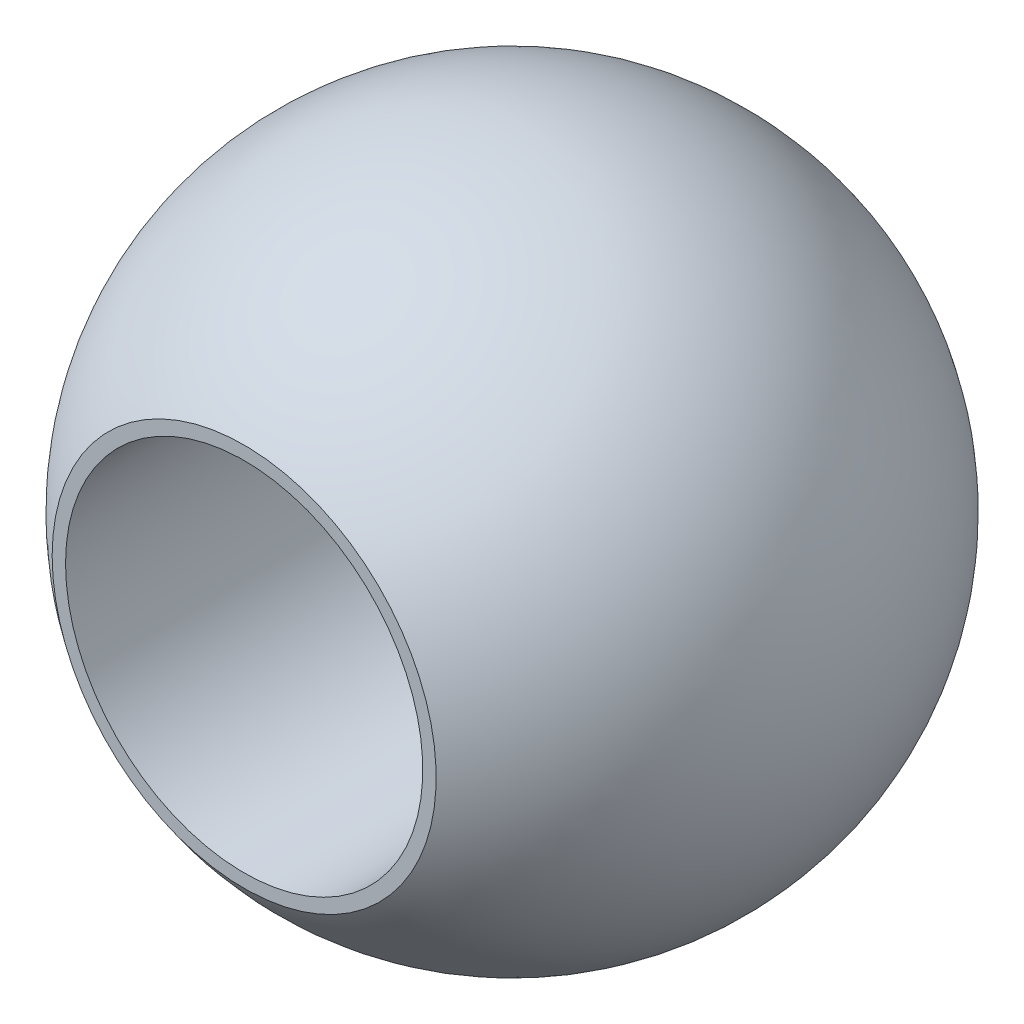
ISO-10303-21;
HEADER;
FILE_DESCRIPTION(('STEP AP214'),'2;1');
FILE_NAME('part.step','',(''),(''),'','','');
FILE_SCHEMA(('AUTOMOTIVE_DESIGN { 1 0 10303 214 1 1 1 1 }'));
ENDSEC;
DATA;
#1=APPLICATION_CONTEXT('core data for automotive mechanical design processes');
#2=APPLICATION_PROTOCOL_DEFINITION('international standard','automotive_design',2000,#1);
#3=PRODUCT_CONTEXT('',#1,'mechanical');
#4=PRODUCT('Part','Part','',(#3));
#5=PRODUCT_RELATED_PRODUCT_CATEGORY('part','',(#4));
#6=PRODUCT_DEFINITION_FORMATION('','',#4);
#7=PRODUCT_DEFINITION_CONTEXT('part definition',#1,'design');
#8=PRODUCT_DEFINITION('design','',#6,#7);
#9=PRODUCT_DEFINITION_SHAPE('','',#8);
#10=(LENGTH_UNIT() NAMED_UNIT(*) SI_UNIT(.MILLI.,.METRE.));
#11=(NAMED_UNIT(*) PLANE_ANGLE_UNIT() SI_UNIT($,.RADIAN.));
#12=(NAMED_UNIT(*) SI_UNIT($,.STERADIAN.) SOLID_ANGLE_UNIT());
#13=UNCERTAINTY_MEASURE_WITH_UNIT(LENGTH_MEASURE(1.E-05),#10,'distance_accuracy_value','');
#14=(GEOMETRIC_REPRESENTATION_CONTEXT(3) GLOBAL_UNCERTAINTY_ASSIGNED_CONTEXT((#13)) GLOBAL_UNIT_ASSIGNED_CONTEXT((#10,
#11,#12)) REPRESENTATION_CONTEXT('',''));
#15=CARTESIAN_POINT('',(0.,0.,0.));
#16=DIRECTION('',(0.,0.,1.));
#17=DIRECTION('',(1.,0.,0.));
#18=AXIS2_PLACEMENT_3D('',#15,#16,#17);
#19=CARTESIAN_POINT('',(4.,0.,-6.));
#20=DIRECTION('',(0.,0.,1.));
#21=DIRECTION('',(1.,0.,0.));
#22=AXIS2_PLACEMENT_3D('',#19,#20,#21);
#23=PLANE('',#22);
#24=CARTESIAN_POINT('',(0.,0.,-6.));
#25=DIRECTION('',(0.,0.,-1.));
#26=DIRECTION('',(-1.,0.,0.));
#27=AXIS2_PLACEMENT_3D('',#24,#25,#26);
#28=CIRCLE('',#27,4.);
#29=CARTESIAN_POINT('',(-4.,0.,-6.));
#30=VERTEX_POINT('',#29);
#31=EDGE_CURVE('E10',#30,#30,#28,.T.);
#32=ORIENTED_EDGE('',*,*,#31,.F.);
#33=EDGE_LOOP('',(#32));
#34=FACE_BOUND('',#33,.T.);
#35=CARTESIAN_POINT('',(0.,0.,-6.));
#36=DIRECTION('',(0.,0.,-1.));
#37=DIRECTION('',(-1.,0.,0.));
#38=AXIS2_PLACEMENT_3D('',#35,#36,#37);
#39=CIRCLE('',#38,4.3);
#40=CARTESIAN_POINT('',(-4.3,0.,-6.));
#41=VERTEX_POINT('',#40);
#42=EDGE_CURVE('E44',#41,#41,#39,.T.);
#43=ORIENTED_EDGE('',*,*,#42,.T.);
#44=EDGE_LOOP('',(#43));
#45=FACE_BOUND('',#44,.T.);
#46=ADVANCED_FACE('F30',(#34,#45),#23,.F.);
#47=CARTESIAN_POINT('',(0.,0.,0.));
#48=DIRECTION('',(0.,0.,-1.));
#49=DIRECTION('',(-1.,0.,0.));
#50=AXIS2_PLACEMENT_3D('',#47,#48,#49);
#51=CYLINDRICAL_SURFACE('',#50,4.);
#52=CARTESIAN_POINT('',(0.,0.,6.));
#53=DIRECTION('',(0.,0.,-1.));
#54=DIRECTION('',(-1.,0.,0.));
#55=AXIS2_PLACEMENT_3D('',#52,#53,#54);
#56=CIRCLE('',#55,4.);
#57=CARTESIAN_POINT('',(-4.,0.,6.));
#58=VERTEX_POINT('',#57);
#59=EDGE_CURVE('E36',#58,#58,#56,.T.);
#60=ORIENTED_EDGE('',*,*,#59,.F.);
#61=EDGE_LOOP('',(#60));
#62=FACE_BOUND('',#61,.T.);
#63=ORIENTED_EDGE('',*,*,#31,.T.);
#64=EDGE_LOOP('',(#63));
#65=FACE_BOUND('',#64,.T.);
#66=ADVANCED_FACE('F59',(#62,#65),#51,.F.);
#67=CARTESIAN_POINT('',(4.3,0.,6.));
#68=DIRECTION('',(0.,0.,-1.));
#69=DIRECTION('',(-1.,0.,0.));
#70=AXIS2_PLACEMENT_3D('',#67,#68,#69);
#71=PLANE('',#70);
#72=CARTESIAN_POINT('',(0.,0.,6.));
#73=DIRECTION('',(0.,0.,-1.));
#74=DIRECTION('',(-1.,0.,0.));
#75=AXIS2_PLACEMENT_3D('',#72,#73,#74);
#76=CIRCLE('',#75,4.3);
#77=CARTESIAN_POINT('',(-4.3,0.,6.));
#78=VERTEX_POINT('',#77);
#79=EDGE_CURVE('E40',#78,#78,#76,.T.);
#80=ORIENTED_EDGE('',*,*,#79,.F.);
#81=EDGE_LOOP('',(#80));
#82=FACE_BOUND('',#81,.T.);
#83=ORIENTED_EDGE('',*,*,#59,.T.);
#84=EDGE_LOOP('',(#83));
#85=FACE_BOUND('',#84,.T.);
#86=ADVANCED_FACE('F54',(#82,#85),#71,.F.);
#87=CARTESIAN_POINT('',(0.,0.,0.));
#88=DIRECTION('',(0.,0.,-1.));
#89=DIRECTION('',(1.,0.,0.));
#90=AXIS2_PLACEMENT_3D('',#87,#88,#89);
#91=SPHERICAL_SURFACE('',#90,7.38173421358423);
#92=ORIENTED_EDGE('',*,*,#42,.F.);
#93=EDGE_LOOP('',(#92));
#94=FACE_BOUND('',#93,.T.);
#95=ORIENTED_EDGE('',*,*,#79,.T.);
#96=EDGE_LOOP('',(#95));
#97=FACE_BOUND('',#96,.T.);
#98=ADVANCED_FACE('F51',(#94,#97),#91,.T.);
#99=CLOSED_SHELL('',(#46,#66,#86,#98));
#100=MANIFOLD_SOLID_BREP('B2',#99);
#101=ADVANCED_BREP_SHAPE_REPRESENTATION('',(#18,#100),#14);
#102=SHAPE_DEFINITION_REPRESENTATION(#9,#101);
ENDSEC;
END-ISO-10303-21;
